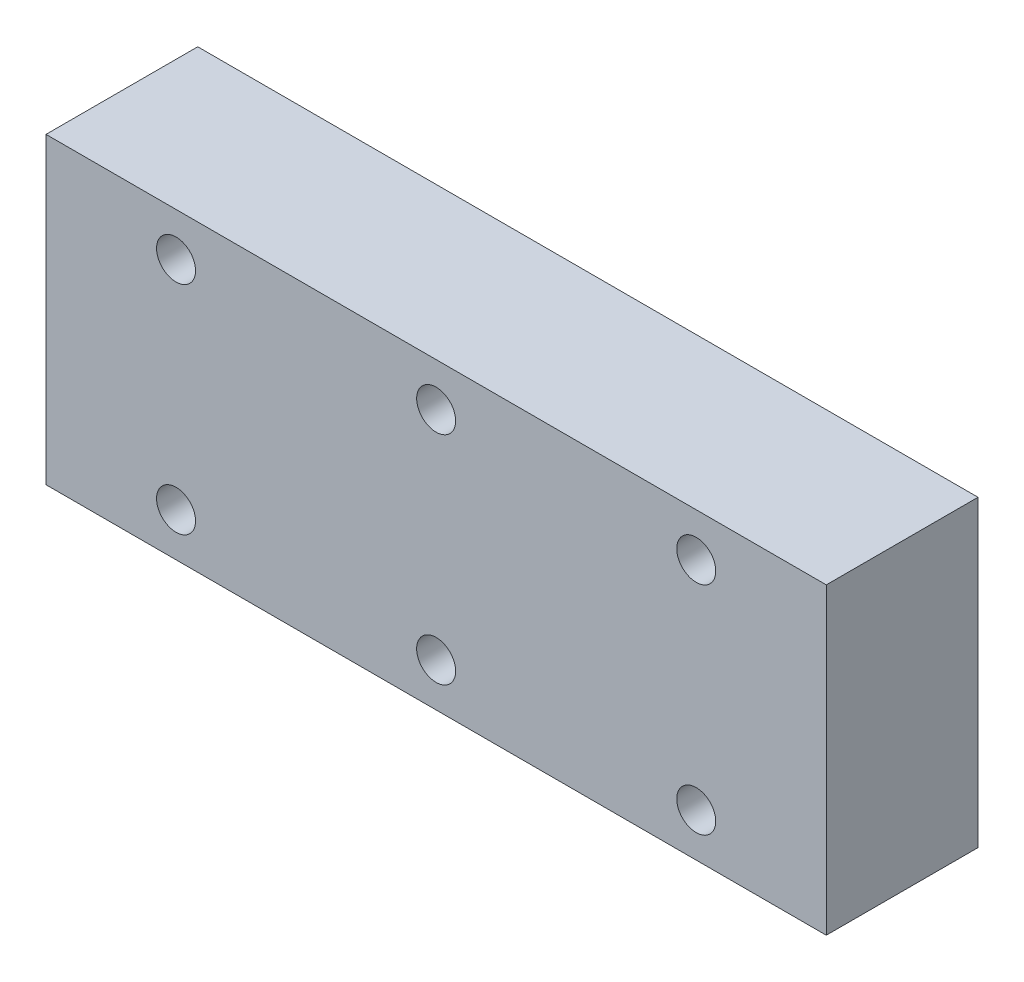
ISO-10303-21;
HEADER;
FILE_DESCRIPTION(('STEP AP214'),'2;1');
FILE_NAME('part.step','',(''),(''),'','','');
FILE_SCHEMA(('AUTOMOTIVE_DESIGN { 1 0 10303 214 1 1 1 1 }'));
ENDSEC;
DATA;
#1=APPLICATION_CONTEXT('core data for automotive mechanical design processes');
#2=APPLICATION_PROTOCOL_DEFINITION('international standard','automotive_design',2000,#1);
#3=PRODUCT_CONTEXT('',#1,'mechanical');
#4=PRODUCT('Part','Part','',(#3));
#5=PRODUCT_RELATED_PRODUCT_CATEGORY('part','',(#4));
#6=PRODUCT_DEFINITION_FORMATION('','',#4);
#7=PRODUCT_DEFINITION_CONTEXT('part definition',#1,'design');
#8=PRODUCT_DEFINITION('design','',#6,#7);
#9=PRODUCT_DEFINITION_SHAPE('','',#8);
#10=(LENGTH_UNIT() NAMED_UNIT(*) SI_UNIT(.MILLI.,.METRE.));
#11=(NAMED_UNIT(*) PLANE_ANGLE_UNIT() SI_UNIT($,.RADIAN.));
#12=(NAMED_UNIT(*) SI_UNIT($,.STERADIAN.) SOLID_ANGLE_UNIT());
#13=UNCERTAINTY_MEASURE_WITH_UNIT(LENGTH_MEASURE(1.E-05),#10,'distance_accuracy_value','');
#14=(GEOMETRIC_REPRESENTATION_CONTEXT(3) GLOBAL_UNCERTAINTY_ASSIGNED_CONTEXT((#13)) GLOBAL_UNIT_ASSIGNED_CONTEXT((#10,
#11,#12)) REPRESENTATION_CONTEXT('',''));
#15=CARTESIAN_POINT('',(0.,0.,0.));
#16=DIRECTION('',(0.,0.,1.));
#17=DIRECTION('',(1.,0.,0.));
#18=AXIS2_PLACEMENT_3D('',#15,#16,#17);
#19=CARTESIAN_POINT('',(9.,0.,3.5));
#20=DIRECTION('',(1.,0.,0.));
#21=DIRECTION('',(0.,0.,-1.));
#22=AXIS2_PLACEMENT_3D('',#19,#20,#21);
#23=PLANE('',#22);
#24=DIRECTION('',(0.,-1.,0.));
#25=VECTOR('',#24,1.);
#26=CARTESIAN_POINT('',(9.,0.,0.));
#27=LINE('',#26,#25);
#28=CARTESIAN_POINT('',(9.,3.5,0.));
#29=VERTEX_POINT('',#28);
#30=CARTESIAN_POINT('',(9.,-3.5,0.));
#31=VERTEX_POINT('',#30);
#32=EDGE_CURVE('E106',#29,#31,#27,.T.);
#33=ORIENTED_EDGE('',*,*,#32,.F.);
#34=DIRECTION('',(0.,0.,-1.));
#35=VECTOR('',#34,1.);
#36=CARTESIAN_POINT('',(9.,3.5,3.5));
#37=LINE('',#36,#35);
#38=CARTESIAN_POINT('',(9.,3.5,3.5));
#39=VERTEX_POINT('',#38);
#40=EDGE_CURVE('E11',#39,#29,#37,.T.);
#41=ORIENTED_EDGE('',*,*,#40,.F.);
#42=DIRECTION('',(0.,-1.,0.));
#43=VECTOR('',#42,1.);
#44=CARTESIAN_POINT('',(9.,0.,3.5));
#45=LINE('',#44,#43);
#46=CARTESIAN_POINT('',(9.,-3.5,3.5));
#47=VERTEX_POINT('',#46);
#48=EDGE_CURVE('E99',#39,#47,#45,.T.);
#49=ORIENTED_EDGE('',*,*,#48,.T.);
#50=DIRECTION('',(0.,0.,-1.));
#51=VECTOR('',#50,1.);
#52=CARTESIAN_POINT('',(9.,-3.5,3.5));
#53=LINE('',#52,#51);
#54=EDGE_CURVE('E79',#47,#31,#53,.T.);
#55=ORIENTED_EDGE('',*,*,#54,.T.);
#56=EDGE_LOOP('',(#33,#41,#49,#55));
#57=FACE_BOUND('',#56,.T.);
#58=ADVANCED_FACE('F39',(#57),#23,.T.);
#59=CARTESIAN_POINT('',(0.,3.5,3.5));
#60=DIRECTION('',(0.,1.,0.));
#61=DIRECTION('',(0.,0.,1.));
#62=AXIS2_PLACEMENT_3D('',#59,#60,#61);
#63=PLANE('',#62);
#64=DIRECTION('',(1.,0.,0.));
#65=VECTOR('',#64,1.);
#66=CARTESIAN_POINT('',(0.,3.5,0.));
#67=LINE('',#66,#65);
#68=CARTESIAN_POINT('',(-9.,3.5,0.));
#69=VERTEX_POINT('',#68);
#70=EDGE_CURVE('E92',#69,#29,#67,.T.);
#71=ORIENTED_EDGE('',*,*,#70,.F.);
#72=DIRECTION('',(0.,0.,-1.));
#73=VECTOR('',#72,1.);
#74=CARTESIAN_POINT('',(-9.,3.5,3.5));
#75=LINE('',#74,#73);
#76=CARTESIAN_POINT('',(-9.,3.5,3.5));
#77=VERTEX_POINT('',#76);
#78=EDGE_CURVE('E48',#77,#69,#75,.T.);
#79=ORIENTED_EDGE('',*,*,#78,.F.);
#80=DIRECTION('',(1.,0.,0.));
#81=VECTOR('',#80,1.);
#82=CARTESIAN_POINT('',(0.,3.5,3.5));
#83=LINE('',#82,#81);
#84=EDGE_CURVE('E90',#77,#39,#83,.T.);
#85=ORIENTED_EDGE('',*,*,#84,.T.);
#86=ORIENTED_EDGE('',*,*,#40,.T.);
#87=EDGE_LOOP('',(#71,#79,#85,#86));
#88=FACE_BOUND('',#87,.T.);
#89=ADVANCED_FACE('F88',(#88),#63,.T.);
#90=CARTESIAN_POINT('',(-9.,0.,3.5));
#91=DIRECTION('',(1.,0.,0.));
#92=DIRECTION('',(0.,0.,-1.));
#93=AXIS2_PLACEMENT_3D('',#90,#91,#92);
#94=PLANE('',#93);
#95=DIRECTION('',(0.,-1.,0.));
#96=VECTOR('',#95,1.);
#97=CARTESIAN_POINT('',(-9.,0.,0.));
#98=LINE('',#97,#96);
#99=CARTESIAN_POINT('',(-9.,-3.5,0.));
#100=VERTEX_POINT('',#99);
#101=EDGE_CURVE('E72',#69,#100,#98,.T.);
#102=ORIENTED_EDGE('',*,*,#101,.T.);
#103=DIRECTION('',(0.,0.,-1.));
#104=VECTOR('',#103,1.);
#105=CARTESIAN_POINT('',(-9.,-3.5,3.5));
#106=LINE('',#105,#104);
#107=CARTESIAN_POINT('',(-9.,-3.5,3.5));
#108=VERTEX_POINT('',#107);
#109=EDGE_CURVE('E93',#108,#100,#106,.T.);
#110=ORIENTED_EDGE('',*,*,#109,.F.);
#111=DIRECTION('',(0.,-1.,0.));
#112=VECTOR('',#111,1.);
#113=CARTESIAN_POINT('',(-9.,0.,3.5));
#114=LINE('',#113,#112);
#115=EDGE_CURVE('E95',#77,#108,#114,.T.);
#116=ORIENTED_EDGE('',*,*,#115,.F.);
#117=ORIENTED_EDGE('',*,*,#78,.T.);
#118=EDGE_LOOP('',(#102,#110,#116,#117));
#119=FACE_BOUND('',#118,.T.);
#120=ADVANCED_FACE('F96',(#119),#94,.F.);
#121=CARTESIAN_POINT('',(0.,-3.5,3.5));
#122=DIRECTION('',(0.,1.,0.));
#123=DIRECTION('',(0.,0.,1.));
#124=AXIS2_PLACEMENT_3D('',#121,#122,#123);
#125=PLANE('',#124);
#126=DIRECTION('',(1.,0.,0.));
#127=VECTOR('',#126,1.);
#128=CARTESIAN_POINT('',(0.,-3.5,0.));
#129=LINE('',#128,#127);
#130=EDGE_CURVE('E101',#100,#31,#129,.T.);
#131=ORIENTED_EDGE('',*,*,#130,.T.);
#132=ORIENTED_EDGE('',*,*,#54,.F.);
#133=DIRECTION('',(1.,0.,0.));
#134=VECTOR('',#133,1.);
#135=CARTESIAN_POINT('',(0.,-3.5,3.5));
#136=LINE('',#135,#134);
#137=EDGE_CURVE('E57',#108,#47,#136,.T.);
#138=ORIENTED_EDGE('',*,*,#137,.F.);
#139=ORIENTED_EDGE('',*,*,#109,.T.);
#140=EDGE_LOOP('',(#131,#132,#138,#139));
#141=FACE_BOUND('',#140,.T.);
#142=ADVANCED_FACE('F155',(#141),#125,.F.);
#143=CARTESIAN_POINT('',(0.,0.,3.5));
#144=DIRECTION('',(0.,0.,1.));
#145=DIRECTION('',(1.,0.,0.));
#146=AXIS2_PLACEMENT_3D('',#143,#144,#145);
#147=PLANE('',#146);
#148=CARTESIAN_POINT('',(-6.,2.5,3.5));
#149=DIRECTION('',(0.,0.,1.));
#150=DIRECTION('',(1.,0.,0.));
#151=AXIS2_PLACEMENT_3D('',#148,#149,#150);
#152=CIRCLE('',#151,0.45);
#153=CARTESIAN_POINT('',(-5.55,2.5,3.5));
#154=VERTEX_POINT('',#153);
#155=EDGE_CURVE('E188',#154,#154,#152,.T.);
#156=ORIENTED_EDGE('',*,*,#155,.F.);
#157=EDGE_LOOP('',(#156));
#158=FACE_BOUND('',#157,.T.);
#159=CARTESIAN_POINT('',(6.,2.5,3.5));
#160=DIRECTION('',(0.,0.,1.));
#161=DIRECTION('',(1.,0.,0.));
#162=AXIS2_PLACEMENT_3D('',#159,#160,#161);
#163=CIRCLE('',#162,0.45);
#164=CARTESIAN_POINT('',(6.45,2.5,3.5));
#165=VERTEX_POINT('',#164);
#166=EDGE_CURVE('E190',#165,#165,#163,.T.);
#167=ORIENTED_EDGE('',*,*,#166,.F.);
#168=EDGE_LOOP('',(#167));
#169=FACE_BOUND('',#168,.T.);
#170=CARTESIAN_POINT('',(6.,-2.5,3.5));
#171=DIRECTION('',(0.,0.,1.));
#172=DIRECTION('',(1.,0.,0.));
#173=AXIS2_PLACEMENT_3D('',#170,#171,#172);
#174=CIRCLE('',#173,0.45);
#175=CARTESIAN_POINT('',(6.45,-2.5,3.5));
#176=VERTEX_POINT('',#175);
#177=EDGE_CURVE('E193',#176,#176,#174,.T.);
#178=ORIENTED_EDGE('',*,*,#177,.F.);
#179=EDGE_LOOP('',(#178));
#180=FACE_BOUND('',#179,.T.);
#181=CARTESIAN_POINT('',(0.,-2.5,3.5));
#182=DIRECTION('',(0.,0.,1.));
#183=DIRECTION('',(1.,0.,0.));
#184=AXIS2_PLACEMENT_3D('',#181,#182,#183);
#185=CIRCLE('',#184,0.45);
#186=CARTESIAN_POINT('',(0.45,-2.5,3.5));
#187=VERTEX_POINT('',#186);
#188=EDGE_CURVE('E185',#187,#187,#185,.T.);
#189=ORIENTED_EDGE('',*,*,#188,.F.);
#190=EDGE_LOOP('',(#189));
#191=FACE_BOUND('',#190,.T.);
#192=CARTESIAN_POINT('',(0.,2.5,3.5));
#193=DIRECTION('',(0.,0.,1.));
#194=DIRECTION('',(1.,0.,0.));
#195=AXIS2_PLACEMENT_3D('',#192,#193,#194);
#196=CIRCLE('',#195,0.45);
#197=CARTESIAN_POINT('',(0.45,2.5,3.5));
#198=VERTEX_POINT('',#197);
#199=EDGE_CURVE('E183',#198,#198,#196,.T.);
#200=ORIENTED_EDGE('',*,*,#199,.F.);
#201=EDGE_LOOP('',(#200));
#202=FACE_BOUND('',#201,.T.);
#203=CARTESIAN_POINT('',(-6.,-2.5,3.5));
#204=DIRECTION('',(0.,0.,1.));
#205=DIRECTION('',(1.,0.,0.));
#206=AXIS2_PLACEMENT_3D('',#203,#204,#205);
#207=CIRCLE('',#206,0.45);
#208=CARTESIAN_POINT('',(-5.55,-2.5,3.5));
#209=VERTEX_POINT('',#208);
#210=EDGE_CURVE('E118',#209,#209,#207,.T.);
#211=ORIENTED_EDGE('',*,*,#210,.F.);
#212=EDGE_LOOP('',(#211));
#213=FACE_BOUND('',#212,.T.);
#214=ORIENTED_EDGE('',*,*,#48,.F.);
#215=ORIENTED_EDGE('',*,*,#84,.F.);
#216=ORIENTED_EDGE('',*,*,#115,.T.);
#217=ORIENTED_EDGE('',*,*,#137,.T.);
#218=EDGE_LOOP('',(#214,#215,#216,#217));
#219=FACE_BOUND('',#218,.T.);
#220=ADVANCED_FACE('F98',(#158,#169,#180,#191,#202,#213,#219),#147,.T.);
#221=CARTESIAN_POINT('',(0.,0.,0.));
#222=DIRECTION('',(0.,0.,1.));
#223=DIRECTION('',(1.,0.,0.));
#224=AXIS2_PLACEMENT_3D('',#221,#222,#223);
#225=PLANE('',#224);
#226=CARTESIAN_POINT('',(-6.,2.5,0.));
#227=DIRECTION('',(0.,0.,1.));
#228=DIRECTION('',(1.,0.,0.));
#229=AXIS2_PLACEMENT_3D('',#226,#227,#228);
#230=CIRCLE('',#229,0.45);
#231=CARTESIAN_POINT('',(-5.55,2.5,0.));
#232=VERTEX_POINT('',#231);
#233=EDGE_CURVE('E42',#232,#232,#230,.T.);
#234=ORIENTED_EDGE('',*,*,#233,.T.);
#235=EDGE_LOOP('',(#234));
#236=FACE_BOUND('',#235,.T.);
#237=CARTESIAN_POINT('',(6.,2.5,0.));
#238=DIRECTION('',(0.,0.,1.));
#239=DIRECTION('',(1.,0.,0.));
#240=AXIS2_PLACEMENT_3D('',#237,#238,#239);
#241=CIRCLE('',#240,0.45);
#242=CARTESIAN_POINT('',(6.45,2.5,0.));
#243=VERTEX_POINT('',#242);
#244=EDGE_CURVE('E126',#243,#243,#241,.T.);
#245=ORIENTED_EDGE('',*,*,#244,.T.);
#246=EDGE_LOOP('',(#245));
#247=FACE_BOUND('',#246,.T.);
#248=CARTESIAN_POINT('',(6.,-2.5,0.));
#249=DIRECTION('',(0.,0.,1.));
#250=DIRECTION('',(1.,0.,0.));
#251=AXIS2_PLACEMENT_3D('',#248,#249,#250);
#252=CIRCLE('',#251,0.45);
#253=CARTESIAN_POINT('',(6.45,-2.5,0.));
#254=VERTEX_POINT('',#253);
#255=EDGE_CURVE('E124',#254,#254,#252,.T.);
#256=ORIENTED_EDGE('',*,*,#255,.T.);
#257=EDGE_LOOP('',(#256));
#258=FACE_BOUND('',#257,.T.);
#259=CARTESIAN_POINT('',(0.,-2.5,0.));
#260=DIRECTION('',(0.,0.,1.));
#261=DIRECTION('',(1.,0.,0.));
#262=AXIS2_PLACEMENT_3D('',#259,#260,#261);
#263=CIRCLE('',#262,0.45);
#264=CARTESIAN_POINT('',(0.45,-2.5,0.));
#265=VERTEX_POINT('',#264);
#266=EDGE_CURVE('E121',#265,#265,#263,.T.);
#267=ORIENTED_EDGE('',*,*,#266,.T.);
#268=EDGE_LOOP('',(#267));
#269=FACE_BOUND('',#268,.T.);
#270=CARTESIAN_POINT('',(0.,2.5,0.));
#271=DIRECTION('',(0.,0.,1.));
#272=DIRECTION('',(1.,0.,0.));
#273=AXIS2_PLACEMENT_3D('',#270,#271,#272);
#274=CIRCLE('',#273,0.45);
#275=CARTESIAN_POINT('',(0.45,2.5,0.));
#276=VERTEX_POINT('',#275);
#277=EDGE_CURVE('E117',#276,#276,#274,.T.);
#278=ORIENTED_EDGE('',*,*,#277,.T.);
#279=EDGE_LOOP('',(#278));
#280=FACE_BOUND('',#279,.T.);
#281=CARTESIAN_POINT('',(-6.,-2.5,0.));
#282=DIRECTION('',(0.,0.,1.));
#283=DIRECTION('',(1.,0.,0.));
#284=AXIS2_PLACEMENT_3D('',#281,#282,#283);
#285=CIRCLE('',#284,0.45);
#286=CARTESIAN_POINT('',(-5.55,-2.5,0.));
#287=VERTEX_POINT('',#286);
#288=EDGE_CURVE('E114',#287,#287,#285,.T.);
#289=ORIENTED_EDGE('',*,*,#288,.T.);
#290=EDGE_LOOP('',(#289));
#291=FACE_BOUND('',#290,.T.);
#292=ORIENTED_EDGE('',*,*,#32,.T.);
#293=ORIENTED_EDGE('',*,*,#130,.F.);
#294=ORIENTED_EDGE('',*,*,#101,.F.);
#295=ORIENTED_EDGE('',*,*,#70,.T.);
#296=EDGE_LOOP('',(#292,#293,#294,#295));
#297=FACE_BOUND('',#296,.T.);
#298=ADVANCED_FACE('F133',(#236,#247,#258,#269,#280,#291,#297),#225,.F.);
#299=CARTESIAN_POINT('',(-6.,-2.5,-2.25));
#300=DIRECTION('',(0.,0.,1.));
#301=DIRECTION('',(1.,0.,0.));
#302=AXIS2_PLACEMENT_3D('',#299,#300,#301);
#303=CYLINDRICAL_SURFACE('',#302,0.45);
#304=ORIENTED_EDGE('',*,*,#210,.T.);
#305=EDGE_LOOP('',(#304));
#306=FACE_BOUND('',#305,.T.);
#307=ORIENTED_EDGE('',*,*,#288,.F.);
#308=EDGE_LOOP('',(#307));
#309=FACE_BOUND('',#308,.T.);
#310=ADVANCED_FACE('F167',(#306,#309),#303,.F.);
#311=CARTESIAN_POINT('',(0.,2.5,-2.25));
#312=DIRECTION('',(0.,0.,1.));
#313=DIRECTION('',(1.,0.,0.));
#314=AXIS2_PLACEMENT_3D('',#311,#312,#313);
#315=CYLINDRICAL_SURFACE('',#314,0.45);
#316=ORIENTED_EDGE('',*,*,#199,.T.);
#317=EDGE_LOOP('',(#316));
#318=FACE_BOUND('',#317,.T.);
#319=ORIENTED_EDGE('',*,*,#277,.F.);
#320=EDGE_LOOP('',(#319));
#321=FACE_BOUND('',#320,.T.);
#322=ADVANCED_FACE('F169',(#318,#321),#315,.F.);
#323=CARTESIAN_POINT('',(0.,-2.5,-2.25));
#324=DIRECTION('',(0.,0.,1.));
#325=DIRECTION('',(1.,0.,0.));
#326=AXIS2_PLACEMENT_3D('',#323,#324,#325);
#327=CYLINDRICAL_SURFACE('',#326,0.45);
#328=ORIENTED_EDGE('',*,*,#188,.T.);
#329=EDGE_LOOP('',(#328));
#330=FACE_BOUND('',#329,.T.);
#331=ORIENTED_EDGE('',*,*,#266,.F.);
#332=EDGE_LOOP('',(#331));
#333=FACE_BOUND('',#332,.T.);
#334=ADVANCED_FACE('F174',(#330,#333),#327,.F.);
#335=CARTESIAN_POINT('',(6.,-2.5,-2.25));
#336=DIRECTION('',(0.,0.,1.));
#337=DIRECTION('',(1.,0.,0.));
#338=AXIS2_PLACEMENT_3D('',#335,#336,#337);
#339=CYLINDRICAL_SURFACE('',#338,0.45);
#340=ORIENTED_EDGE('',*,*,#177,.T.);
#341=EDGE_LOOP('',(#340));
#342=FACE_BOUND('',#341,.T.);
#343=ORIENTED_EDGE('',*,*,#255,.F.);
#344=EDGE_LOOP('',(#343));
#345=FACE_BOUND('',#344,.T.);
#346=ADVANCED_FACE('F143',(#342,#345),#339,.F.);
#347=CARTESIAN_POINT('',(6.,2.5,-2.25));
#348=DIRECTION('',(0.,0.,1.));
#349=DIRECTION('',(1.,0.,0.));
#350=AXIS2_PLACEMENT_3D('',#347,#348,#349);
#351=CYLINDRICAL_SURFACE('',#350,0.45);
#352=ORIENTED_EDGE('',*,*,#166,.T.);
#353=EDGE_LOOP('',(#352));
#354=FACE_BOUND('',#353,.T.);
#355=ORIENTED_EDGE('',*,*,#244,.F.);
#356=EDGE_LOOP('',(#355));
#357=FACE_BOUND('',#356,.T.);
#358=ADVANCED_FACE('F137',(#354,#357),#351,.F.);
#359=CARTESIAN_POINT('',(-6.,2.5,-2.25));
#360=DIRECTION('',(0.,0.,1.));
#361=DIRECTION('',(1.,0.,0.));
#362=AXIS2_PLACEMENT_3D('',#359,#360,#361);
#363=CYLINDRICAL_SURFACE('',#362,0.45);
#364=ORIENTED_EDGE('',*,*,#155,.T.);
#365=EDGE_LOOP('',(#364));
#366=FACE_BOUND('',#365,.T.);
#367=ORIENTED_EDGE('',*,*,#233,.F.);
#368=EDGE_LOOP('',(#367));
#369=FACE_BOUND('',#368,.T.);
#370=ADVANCED_FACE('F135',(#366,#369),#363,.F.);
#371=CLOSED_SHELL('',(#58,#89,#120,#142,#220,#298,#310,#322,#334,#346,#358,#370));
#372=MANIFOLD_SOLID_BREP('B2',#371);
#373=ADVANCED_BREP_SHAPE_REPRESENTATION('',(#18,#372),#14);
#374=SHAPE_DEFINITION_REPRESENTATION(#9,#373);
ENDSEC;
END-ISO-10303-21;
